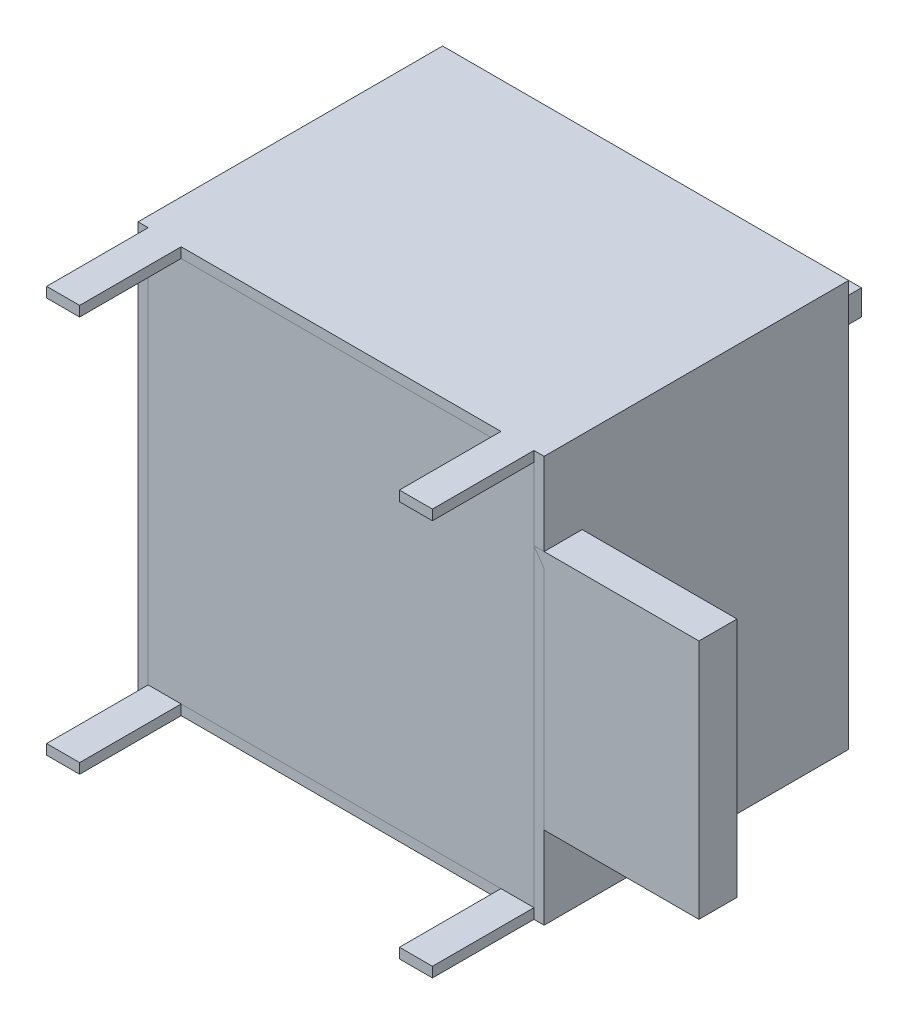
ISO-10303-21;
HEADER;
FILE_DESCRIPTION(('STEP AP214'),'2;1');
FILE_NAME('part.step','',(''),(''),'','','');
FILE_SCHEMA(('AUTOMOTIVE_DESIGN { 1 0 10303 214 1 1 1 1 }'));
ENDSEC;
DATA;
#1=APPLICATION_CONTEXT('core data for automotive mechanical design processes');
#2=APPLICATION_PROTOCOL_DEFINITION('international standard','automotive_design',2000,#1);
#3=PRODUCT_CONTEXT('',#1,'mechanical');
#4=PRODUCT('Part','Part','',(#3));
#5=PRODUCT_RELATED_PRODUCT_CATEGORY('part','',(#4));
#6=PRODUCT_DEFINITION_FORMATION('','',#4);
#7=PRODUCT_DEFINITION_CONTEXT('part definition',#1,'design');
#8=PRODUCT_DEFINITION('design','',#6,#7);
#9=PRODUCT_DEFINITION_SHAPE('','',#8);
#10=(LENGTH_UNIT() NAMED_UNIT(*) SI_UNIT(.MILLI.,.METRE.));
#11=(NAMED_UNIT(*) PLANE_ANGLE_UNIT() SI_UNIT($,.RADIAN.));
#12=(NAMED_UNIT(*) SI_UNIT($,.STERADIAN.) SOLID_ANGLE_UNIT());
#13=UNCERTAINTY_MEASURE_WITH_UNIT(LENGTH_MEASURE(1.E-05),#10,'distance_accuracy_value','');
#14=(GEOMETRIC_REPRESENTATION_CONTEXT(3) GLOBAL_UNCERTAINTY_ASSIGNED_CONTEXT((#13)) GLOBAL_UNIT_ASSIGNED_CONTEXT((#10,
#11,#12)) REPRESENTATION_CONTEXT('',''));
#15=CARTESIAN_POINT('',(0.,0.,0.));
#16=DIRECTION('',(0.,0.,1.));
#17=DIRECTION('',(1.,0.,0.));
#18=AXIS2_PLACEMENT_3D('',#15,#16,#17);
#19=CARTESIAN_POINT('',(0.4,15.6,10.5));
#20=DIRECTION('',(-1.,0.,0.));
#21=DIRECTION('',(0.,0.,1.));
#22=AXIS2_PLACEMENT_3D('',#19,#20,#21);
#23=PLANE('',#22);
#24=DIRECTION('',(0.,-1.,0.));
#25=VECTOR('',#24,1.);
#26=CARTESIAN_POINT('',(0.4,15.6,12.));
#27=LINE('',#26,#25);
#28=CARTESIAN_POINT('',(0.4,15.6,12.));
#29=VERTEX_POINT('',#28);
#30=CARTESIAN_POINT('',(0.4,0.399999999999999,12.));
#31=VERTEX_POINT('',#30);
#32=EDGE_CURVE('E144',#29,#31,#27,.T.);
#33=ORIENTED_EDGE('',*,*,#32,.F.);
#34=DIRECTION('',(0.,0.,1.));
#35=VECTOR('',#34,1.);
#36=CARTESIAN_POINT('',(0.4,15.6,10.5));
#37=LINE('',#36,#35);
#38=CARTESIAN_POINT('',(0.4,15.6,10.5));
#39=VERTEX_POINT('',#38);
#40=EDGE_CURVE('E12',#39,#29,#37,.T.);
#41=ORIENTED_EDGE('',*,*,#40,.F.);
#42=DIRECTION('',(0.,-1.,0.));
#43=VECTOR('',#42,1.);
#44=CARTESIAN_POINT('',(0.4,15.6,10.5));
#45=LINE('',#44,#43);
#46=CARTESIAN_POINT('',(0.4,0.399999999999999,10.5));
#47=VERTEX_POINT('',#46);
#48=EDGE_CURVE('E164',#39,#47,#45,.T.);
#49=ORIENTED_EDGE('',*,*,#48,.T.);
#50=DIRECTION('',(0.,0.,1.));
#51=VECTOR('',#50,1.);
#52=CARTESIAN_POINT('',(0.4,0.399999999999999,10.5));
#53=LINE('',#52,#51);
#54=EDGE_CURVE('E50',#47,#31,#53,.T.);
#55=ORIENTED_EDGE('',*,*,#54,.T.);
#56=EDGE_LOOP('',(#33,#41,#49,#55));
#57=FACE_BOUND('',#56,.T.);
#58=ADVANCED_FACE('F47',(#57),#23,.T.);
#59=CARTESIAN_POINT('',(0.4,15.6,10.5));
#60=DIRECTION('',(0.,1.,0.));
#61=DIRECTION('',(0.,0.,1.));
#62=AXIS2_PLACEMENT_3D('',#59,#60,#61);
#63=PLANE('',#62);
#64=DIRECTION('',(-1.,0.,0.));
#65=VECTOR('',#64,1.);
#66=CARTESIAN_POINT('',(0.4,15.6,12.));
#67=LINE('',#66,#65);
#68=CARTESIAN_POINT('',(15.6,15.6,12.));
#69=VERTEX_POINT('',#68);
#70=EDGE_CURVE('E162',#69,#29,#67,.T.);
#71=ORIENTED_EDGE('',*,*,#70,.F.);
#72=DIRECTION('',(0.,0.,1.));
#73=VECTOR('',#72,1.);
#74=CARTESIAN_POINT('',(15.6,15.6,10.5));
#75=LINE('',#74,#73);
#76=CARTESIAN_POINT('',(15.6,15.6,10.5));
#77=VERTEX_POINT('',#76);
#78=EDGE_CURVE('E56',#77,#69,#75,.T.);
#79=ORIENTED_EDGE('',*,*,#78,.F.);
#80=DIRECTION('',(-1.,0.,0.));
#81=VECTOR('',#80,1.);
#82=CARTESIAN_POINT('',(0.4,15.6,10.5));
#83=LINE('',#82,#81);
#84=EDGE_CURVE('E134',#77,#39,#83,.T.);
#85=ORIENTED_EDGE('',*,*,#84,.T.);
#86=ORIENTED_EDGE('',*,*,#40,.T.);
#87=EDGE_LOOP('',(#71,#79,#85,#86));
#88=FACE_BOUND('',#87,.T.);
#89=ADVANCED_FACE('F176',(#88),#63,.T.);
#90=CARTESIAN_POINT('',(15.6,15.6,10.5));
#91=DIRECTION('',(1.,0.,0.));
#92=DIRECTION('',(0.,1.,0.));
#93=AXIS2_PLACEMENT_3D('',#90,#91,#92);
#94=PLANE('',#93);
#95=DIRECTION('',(0.,1.,0.));
#96=VECTOR('',#95,1.);
#97=CARTESIAN_POINT('',(15.6,15.6,12.));
#98=LINE('',#97,#96);
#99=CARTESIAN_POINT('',(15.6,12.75,12.));
#100=VERTEX_POINT('',#99);
#101=EDGE_CURVE('E121',#100,#69,#98,.T.);
#102=ORIENTED_EDGE('',*,*,#101,.F.);
#103=DIRECTION('',(0.,0.,1.));
#104=VECTOR('',#103,1.);
#105=CARTESIAN_POINT('',(15.6,12.75,10.5));
#106=LINE('',#105,#104);
#107=CARTESIAN_POINT('',(15.6,12.75,10.5));
#108=VERTEX_POINT('',#107);
#109=EDGE_CURVE('E116',#108,#100,#106,.T.);
#110=ORIENTED_EDGE('',*,*,#109,.F.);
#111=DIRECTION('',(0.,1.,0.));
#112=VECTOR('',#111,1.);
#113=CARTESIAN_POINT('',(15.6,15.6,10.5));
#114=LINE('',#113,#112);
#115=EDGE_CURVE('E119',#108,#77,#114,.T.);
#116=ORIENTED_EDGE('',*,*,#115,.T.);
#117=ORIENTED_EDGE('',*,*,#78,.T.);
#118=EDGE_LOOP('',(#102,#110,#116,#117));
#119=FACE_BOUND('',#118,.T.);
#120=ADVANCED_FACE('F118',(#119),#94,.T.);
#121=CARTESIAN_POINT('',(15.6,12.75,10.5));
#122=DIRECTION('',(0.,1.,0.));
#123=DIRECTION('',(0.,0.,1.));
#124=AXIS2_PLACEMENT_3D('',#121,#122,#123);
#125=PLANE('',#124);
#126=DIRECTION('',(-1.,0.,0.));
#127=VECTOR('',#126,1.);
#128=CARTESIAN_POINT('',(15.6,12.75,12.));
#129=LINE('',#128,#127);
#130=CARTESIAN_POINT('',(22.1,12.75,12.));
#131=VERTEX_POINT('',#130);
#132=EDGE_CURVE('E159',#131,#100,#129,.T.);
#133=ORIENTED_EDGE('',*,*,#132,.F.);
#134=DIRECTION('',(0.,0.,1.));
#135=VECTOR('',#134,1.);
#136=CARTESIAN_POINT('',(22.1,12.75,10.5));
#137=LINE('',#136,#135);
#138=CARTESIAN_POINT('',(22.1,12.75,10.5));
#139=VERTEX_POINT('',#138);
#140=EDGE_CURVE('E126',#139,#131,#137,.T.);
#141=ORIENTED_EDGE('',*,*,#140,.F.);
#142=DIRECTION('',(-1.,0.,0.));
#143=VECTOR('',#142,1.);
#144=CARTESIAN_POINT('',(15.6,12.75,10.5));
#145=LINE('',#144,#143);
#146=EDGE_CURVE('E132',#139,#108,#145,.T.);
#147=ORIENTED_EDGE('',*,*,#146,.T.);
#148=ORIENTED_EDGE('',*,*,#109,.T.);
#149=EDGE_LOOP('',(#133,#141,#147,#148));
#150=FACE_BOUND('',#149,.T.);
#151=ADVANCED_FACE('F136',(#150),#125,.T.);
#152=CARTESIAN_POINT('',(22.1,12.75,10.5));
#153=DIRECTION('',(1.,0.,0.));
#154=DIRECTION('',(0.,0.,-1.));
#155=AXIS2_PLACEMENT_3D('',#152,#153,#154);
#156=PLANE('',#155);
#157=DIRECTION('',(0.,1.,0.));
#158=VECTOR('',#157,1.);
#159=CARTESIAN_POINT('',(22.1,12.75,12.));
#160=LINE('',#159,#158);
#161=CARTESIAN_POINT('',(22.1,3.25,12.));
#162=VERTEX_POINT('',#161);
#163=EDGE_CURVE('E156',#162,#131,#160,.T.);
#164=ORIENTED_EDGE('',*,*,#163,.F.);
#165=DIRECTION('',(0.,0.,1.));
#166=VECTOR('',#165,1.);
#167=CARTESIAN_POINT('',(22.1,3.25,10.5));
#168=LINE('',#167,#166);
#169=CARTESIAN_POINT('',(22.1,3.25,10.5));
#170=VERTEX_POINT('',#169);
#171=EDGE_CURVE('E168',#170,#162,#168,.T.);
#172=ORIENTED_EDGE('',*,*,#171,.F.);
#173=DIRECTION('',(0.,1.,0.));
#174=VECTOR('',#173,1.);
#175=CARTESIAN_POINT('',(22.1,12.75,10.5));
#176=LINE('',#175,#174);
#177=EDGE_CURVE('E137',#170,#139,#176,.T.);
#178=ORIENTED_EDGE('',*,*,#177,.T.);
#179=ORIENTED_EDGE('',*,*,#140,.T.);
#180=EDGE_LOOP('',(#164,#172,#178,#179));
#181=FACE_BOUND('',#180,.T.);
#182=ADVANCED_FACE('F189',(#181),#156,.T.);
#183=CARTESIAN_POINT('',(15.6,3.25,10.5));
#184=DIRECTION('',(0.,-1.,0.));
#185=DIRECTION('',(0.,0.,-1.));
#186=AXIS2_PLACEMENT_3D('',#183,#184,#185);
#187=PLANE('',#186);
#188=DIRECTION('',(1.,0.,0.));
#189=VECTOR('',#188,1.);
#190=CARTESIAN_POINT('',(15.6,3.25,12.));
#191=LINE('',#190,#189);
#192=CARTESIAN_POINT('',(15.6,3.25,12.));
#193=VERTEX_POINT('',#192);
#194=EDGE_CURVE('E153',#193,#162,#191,.T.);
#195=ORIENTED_EDGE('',*,*,#194,.F.);
#196=DIRECTION('',(0.,0.,1.));
#197=VECTOR('',#196,1.);
#198=CARTESIAN_POINT('',(15.6,3.25,10.5));
#199=LINE('',#198,#197);
#200=CARTESIAN_POINT('',(15.6,3.25,10.5));
#201=VERTEX_POINT('',#200);
#202=EDGE_CURVE('E170',#201,#193,#199,.T.);
#203=ORIENTED_EDGE('',*,*,#202,.F.);
#204=DIRECTION('',(1.,0.,0.));
#205=VECTOR('',#204,1.);
#206=CARTESIAN_POINT('',(15.6,3.25,10.5));
#207=LINE('',#206,#205);
#208=EDGE_CURVE('E139',#201,#170,#207,.T.);
#209=ORIENTED_EDGE('',*,*,#208,.T.);
#210=ORIENTED_EDGE('',*,*,#171,.T.);
#211=EDGE_LOOP('',(#195,#203,#209,#210));
#212=FACE_BOUND('',#211,.T.);
#213=ADVANCED_FACE('F192',(#212),#187,.T.);
#214=CARTESIAN_POINT('',(15.6,3.25,10.5));
#215=DIRECTION('',(1.,0.,0.));
#216=DIRECTION('',(0.,1.,0.));
#217=AXIS2_PLACEMENT_3D('',#214,#215,#216);
#218=PLANE('',#217);
#219=DIRECTION('',(0.,1.,0.));
#220=VECTOR('',#219,1.);
#221=CARTESIAN_POINT('',(15.6,3.25,12.));
#222=LINE('',#221,#220);
#223=CARTESIAN_POINT('',(15.6,0.399999999999999,12.));
#224=VERTEX_POINT('',#223);
#225=EDGE_CURVE('E150',#224,#193,#222,.T.);
#226=ORIENTED_EDGE('',*,*,#225,.F.);
#227=DIRECTION('',(0.,0.,1.));
#228=VECTOR('',#227,1.);
#229=CARTESIAN_POINT('',(15.6,0.399999999999999,10.5));
#230=LINE('',#229,#228);
#231=CARTESIAN_POINT('',(15.6,0.399999999999999,10.5));
#232=VERTEX_POINT('',#231);
#233=EDGE_CURVE('E171',#232,#224,#230,.T.);
#234=ORIENTED_EDGE('',*,*,#233,.F.);
#235=DIRECTION('',(0.,1.,0.));
#236=VECTOR('',#235,1.);
#237=CARTESIAN_POINT('',(15.6,3.25,10.5));
#238=LINE('',#237,#236);
#239=EDGE_CURVE('E267',#232,#201,#238,.T.);
#240=ORIENTED_EDGE('',*,*,#239,.T.);
#241=ORIENTED_EDGE('',*,*,#202,.T.);
#242=EDGE_LOOP('',(#226,#234,#240,#241));
#243=FACE_BOUND('',#242,.T.);
#244=ADVANCED_FACE('F196',(#243),#218,.T.);
#245=CARTESIAN_POINT('',(0.4,0.399999999999999,10.5));
#246=DIRECTION('',(0.,-1.,0.));
#247=DIRECTION('',(0.,0.,-1.));
#248=AXIS2_PLACEMENT_3D('',#245,#246,#247);
#249=PLANE('',#248);
#250=DIRECTION('',(1.,0.,0.));
#251=VECTOR('',#250,1.);
#252=CARTESIAN_POINT('',(0.4,0.399999999999999,12.));
#253=LINE('',#252,#251);
#254=EDGE_CURVE('E147',#31,#224,#253,.T.);
#255=ORIENTED_EDGE('',*,*,#254,.F.);
#256=ORIENTED_EDGE('',*,*,#54,.F.);
#257=DIRECTION('',(1.,0.,0.));
#258=VECTOR('',#257,1.);
#259=CARTESIAN_POINT('',(0.4,0.399999999999999,10.5));
#260=LINE('',#259,#258);
#261=EDGE_CURVE('E268',#47,#232,#260,.T.);
#262=ORIENTED_EDGE('',*,*,#261,.T.);
#263=ORIENTED_EDGE('',*,*,#233,.T.);
#264=EDGE_LOOP('',(#255,#256,#262,#263));
#265=FACE_BOUND('',#264,.T.);
#266=ADVANCED_FACE('F173',(#265),#249,.T.);
#267=CARTESIAN_POINT('',(0.,0.,10.5));
#268=DIRECTION('',(0.,0.,1.));
#269=DIRECTION('',(1.,0.,0.));
#270=AXIS2_PLACEMENT_3D('',#267,#268,#269);
#271=PLANE('',#270);
#272=ORIENTED_EDGE('',*,*,#48,.F.);
#273=ORIENTED_EDGE('',*,*,#84,.F.);
#274=ORIENTED_EDGE('',*,*,#115,.F.);
#275=ORIENTED_EDGE('',*,*,#146,.F.);
#276=ORIENTED_EDGE('',*,*,#177,.F.);
#277=ORIENTED_EDGE('',*,*,#208,.F.);
#278=ORIENTED_EDGE('',*,*,#239,.F.);
#279=ORIENTED_EDGE('',*,*,#261,.F.);
#280=EDGE_LOOP('',(#272,#273,#274,#275,#276,#277,#278,#279));
#281=FACE_BOUND('',#280,.T.);
#282=ADVANCED_FACE('F130',(#281),#271,.F.);
#283=CARTESIAN_POINT('',(0.,0.,12.));
#284=DIRECTION('',(0.,0.,1.));
#285=DIRECTION('',(1.,0.,0.));
#286=AXIS2_PLACEMENT_3D('',#283,#284,#285);
#287=PLANE('',#286);
#288=ORIENTED_EDGE('',*,*,#32,.T.);
#289=ORIENTED_EDGE('',*,*,#254,.T.);
#290=ORIENTED_EDGE('',*,*,#225,.T.);
#291=ORIENTED_EDGE('',*,*,#194,.T.);
#292=ORIENTED_EDGE('',*,*,#163,.T.);
#293=ORIENTED_EDGE('',*,*,#132,.T.);
#294=ORIENTED_EDGE('',*,*,#101,.T.);
#295=ORIENTED_EDGE('',*,*,#70,.T.);
#296=EDGE_LOOP('',(#288,#289,#290,#291,#292,#293,#294,#295));
#297=FACE_BOUND('',#296,.T.);
#298=ADVANCED_FACE('F175',(#297),#287,.T.);
#299=CLOSED_SHELL('',(#58,#89,#120,#151,#182,#213,#244,#266,#282,#298));
#300=MANIFOLD_SOLID_BREP('B2',#299);
#301=CARTESIAN_POINT('',(0.,0.,0.));
#302=DIRECTION('',(0.,0.,-1.));
#303=DIRECTION('',(-1.,0.,0.));
#304=AXIS2_PLACEMENT_3D('',#301,#302,#303);
#305=PLANE('',#304);
#306=DIRECTION('',(0.,-1.,0.));
#307=VECTOR('',#306,1.);
#308=CARTESIAN_POINT('',(0.,0.,0.));
#309=LINE('',#308,#307);
#310=CARTESIAN_POINT('',(0.,16.,0.));
#311=VERTEX_POINT('',#310);
#312=CARTESIAN_POINT('',(0.,0.,0.));
#313=VERTEX_POINT('',#312);
#314=EDGE_CURVE('E615',#311,#313,#309,.T.);
#315=ORIENTED_EDGE('',*,*,#314,.F.);
#316=DIRECTION('',(-1.,0.,0.));
#317=VECTOR('',#316,1.);
#318=CARTESIAN_POINT('',(0.,16.,0.));
#319=LINE('',#318,#317);
#320=CARTESIAN_POINT('',(16.,16.,0.));
#321=VERTEX_POINT('',#320);
#322=EDGE_CURVE('E607',#321,#311,#319,.T.);
#323=ORIENTED_EDGE('',*,*,#322,.F.);
#324=DIRECTION('',(0.,1.,0.));
#325=VECTOR('',#324,1.);
#326=CARTESIAN_POINT('',(16.,0.,0.));
#327=LINE('',#326,#325);
#328=CARTESIAN_POINT('',(16.,0.,0.));
#329=VERTEX_POINT('',#328);
#330=EDGE_CURVE('E631',#329,#321,#327,.T.);
#331=ORIENTED_EDGE('',*,*,#330,.F.);
#332=DIRECTION('',(1.,0.,0.));
#333=VECTOR('',#332,1.);
#334=CARTESIAN_POINT('',(0.,0.,0.));
#335=LINE('',#334,#333);
#336=EDGE_CURVE('E632',#313,#329,#335,.T.);
#337=ORIENTED_EDGE('',*,*,#336,.F.);
#338=EDGE_LOOP('',(#315,#323,#331,#337));
#339=FACE_BOUND('',#338,.T.);
#340=DIRECTION('',(1.,0.,0.));
#341=VECTOR('',#340,1.);
#342=CARTESIAN_POINT('',(9.,8.5,0.));
#343=LINE('',#342,#341);
#344=CARTESIAN_POINT('',(7.,8.5,0.));
#345=VERTEX_POINT('',#344);
#346=CARTESIAN_POINT('',(9.,8.5,0.));
#347=VERTEX_POINT('',#346);
#348=EDGE_CURVE('E1034',#345,#347,#343,.T.);
#349=ORIENTED_EDGE('',*,*,#348,.F.);
#350=DIRECTION('',(0.,1.,0.));
#351=VECTOR('',#350,1.);
#352=CARTESIAN_POINT('',(7.,8.5,0.));
#353=LINE('',#352,#351);
#354=CARTESIAN_POINT('',(7.,7.5,0.));
#355=VERTEX_POINT('',#354);
#356=EDGE_CURVE('E474',#355,#345,#353,.T.);
#357=ORIENTED_EDGE('',*,*,#356,.F.);
#358=DIRECTION('',(-1.,0.,0.));
#359=VECTOR('',#358,1.);
#360=CARTESIAN_POINT('',(9.,7.5,0.));
#361=LINE('',#360,#359);
#362=CARTESIAN_POINT('',(9.,7.5,0.));
#363=VERTEX_POINT('',#362);
#364=EDGE_CURVE('E470',#363,#355,#361,.T.);
#365=ORIENTED_EDGE('',*,*,#364,.F.);
#366=DIRECTION('',(0.,-1.,0.));
#367=VECTOR('',#366,1.);
#368=CARTESIAN_POINT('',(9.,8.5,0.));
#369=LINE('',#368,#367);
#370=EDGE_CURVE('E1031',#347,#363,#369,.T.);
#371=ORIENTED_EDGE('',*,*,#370,.F.);
#372=EDGE_LOOP('',(#349,#357,#365,#371));
#373=FACE_BOUND('',#372,.T.);
#374=ADVANCED_FACE('F275',(#339,#373),#305,.T.);
#375=CARTESIAN_POINT('',(0.,0.,12.));
#376=DIRECTION('',(0.,0.,-1.));
#377=DIRECTION('',(-1.,0.,0.));
#378=AXIS2_PLACEMENT_3D('',#375,#376,#377);
#379=PLANE('',#378);
#380=DIRECTION('',(1.,0.,0.));
#381=VECTOR('',#380,1.);
#382=CARTESIAN_POINT('',(0.,0.,12.));
#383=LINE('',#382,#381);
#384=CARTESIAN_POINT('',(0.,0.,12.));
#385=VERTEX_POINT('',#384);
#386=CARTESIAN_POINT('',(0.4,0.,12.));
#387=VERTEX_POINT('',#386);
#388=EDGE_CURVE('E608',#385,#387,#383,.T.);
#389=ORIENTED_EDGE('',*,*,#388,.T.);
#390=DIRECTION('',(0.,1.,0.));
#391=VECTOR('',#390,1.);
#392=CARTESIAN_POINT('',(0.4,0.399999999999999,12.));
#393=LINE('',#392,#391);
#394=CARTESIAN_POINT('',(0.4,0.399999999999999,12.));
#395=VERTEX_POINT('',#394);
#396=EDGE_CURVE('E476',#387,#395,#393,.T.);
#397=ORIENTED_EDGE('',*,*,#396,.T.);
#398=DIRECTION('',(0.,-1.,0.));
#399=VECTOR('',#398,1.);
#400=CARTESIAN_POINT('',(0.4,0.,12.));
#401=LINE('',#400,#399);
#402=CARTESIAN_POINT('',(0.4,15.6,12.));
#403=VERTEX_POINT('',#402);
#404=EDGE_CURVE('E663',#403,#395,#401,.T.);
#405=ORIENTED_EDGE('',*,*,#404,.F.);
#406=DIRECTION('',(0.,-1.,0.));
#407=VECTOR('',#406,1.);
#408=CARTESIAN_POINT('',(0.4,15.6,12.));
#409=LINE('',#408,#407);
#410=CARTESIAN_POINT('',(0.4,16.,12.));
#411=VERTEX_POINT('',#410);
#412=EDGE_CURVE('E556',#411,#403,#409,.T.);
#413=ORIENTED_EDGE('',*,*,#412,.F.);
#414=DIRECTION('',(-1.,0.,0.));
#415=VECTOR('',#414,1.);
#416=CARTESIAN_POINT('',(0.,16.,12.));
#417=LINE('',#416,#415);
#418=CARTESIAN_POINT('',(0.,16.,12.));
#419=VERTEX_POINT('',#418);
#420=EDGE_CURVE('E576',#411,#419,#417,.T.);
#421=ORIENTED_EDGE('',*,*,#420,.T.);
#422=DIRECTION('',(0.,-1.,0.));
#423=VECTOR('',#422,1.);
#424=CARTESIAN_POINT('',(0.,0.,12.));
#425=LINE('',#424,#423);
#426=EDGE_CURVE('E603',#419,#385,#425,.T.);
#427=ORIENTED_EDGE('',*,*,#426,.T.);
#428=EDGE_LOOP('',(#389,#397,#405,#413,#421,#427));
#429=FACE_BOUND('',#428,.T.);
#430=ADVANCED_FACE('F719',(#429),#379,.F.);
#431=DIRECTION('',(0.,1.,0.));
#432=VECTOR('',#431,1.);
#433=CARTESIAN_POINT('',(15.6,0.399999999999999,12.));
#434=LINE('',#433,#432);
#435=CARTESIAN_POINT('',(15.6,0.,12.));
#436=VERTEX_POINT('',#435);
#437=CARTESIAN_POINT('',(15.6,0.4,12.));
#438=VERTEX_POINT('',#437);
#439=EDGE_CURVE('E504',#436,#438,#434,.T.);
#440=ORIENTED_EDGE('',*,*,#439,.F.);
#441=CARTESIAN_POINT('',(16.,0.,12.));
#442=VERTEX_POINT('',#441);
#443=EDGE_CURVE('E606',#436,#442,#383,.T.);
#444=ORIENTED_EDGE('',*,*,#443,.T.);
#445=DIRECTION('',(0.,1.,0.));
#446=VECTOR('',#445,1.);
#447=CARTESIAN_POINT('',(16.,0.,12.));
#448=LINE('',#447,#446);
#449=CARTESIAN_POINT('',(16.,16.,12.));
#450=VERTEX_POINT('',#449);
#451=EDGE_CURVE('E611',#442,#450,#448,.T.);
#452=ORIENTED_EDGE('',*,*,#451,.T.);
#453=CARTESIAN_POINT('',(15.6,16.,12.));
#454=VERTEX_POINT('',#453);
#455=EDGE_CURVE('E619',#450,#454,#417,.T.);
#456=ORIENTED_EDGE('',*,*,#455,.T.);
#457=DIRECTION('',(0.,-1.,0.));
#458=VECTOR('',#457,1.);
#459=CARTESIAN_POINT('',(15.6,15.6,12.));
#460=LINE('',#459,#458);
#461=CARTESIAN_POINT('',(15.6,15.6,12.));
#462=VERTEX_POINT('',#461);
#463=EDGE_CURVE('E529',#454,#462,#460,.T.);
#464=ORIENTED_EDGE('',*,*,#463,.T.);
#465=DIRECTION('',(0.,1.,0.));
#466=VECTOR('',#465,1.);
#467=CARTESIAN_POINT('',(15.6,0.,12.));
#468=LINE('',#467,#466);
#469=EDGE_CURVE('E598',#438,#462,#468,.T.);
#470=ORIENTED_EDGE('',*,*,#469,.F.);
#471=EDGE_LOOP('',(#440,#444,#452,#456,#464,#470));
#472=FACE_BOUND('',#471,.T.);
#473=ADVANCED_FACE('F678',(#472),#379,.F.);
#474=DIRECTION('',(1.,0.,0.));
#475=VECTOR('',#474,1.);
#476=CARTESIAN_POINT('',(0.,0.4,12.));
#477=LINE('',#476,#475);
#478=CARTESIAN_POINT('',(1.7,0.4,12.));
#479=VERTEX_POINT('',#478);
#480=CARTESIAN_POINT('',(14.3,0.399999999999999,12.));
#481=VERTEX_POINT('',#480);
#482=EDGE_CURVE('E664',#479,#481,#477,.T.);
#483=ORIENTED_EDGE('',*,*,#482,.F.);
#484=DIRECTION('',(0.,-1.,0.));
#485=VECTOR('',#484,1.);
#486=CARTESIAN_POINT('',(1.7,0.399999999999999,12.));
#487=LINE('',#486,#485);
#488=CARTESIAN_POINT('',(1.7,0.,12.));
#489=VERTEX_POINT('',#488);
#490=EDGE_CURVE('E301',#479,#489,#487,.T.);
#491=ORIENTED_EDGE('',*,*,#490,.T.);
#492=CARTESIAN_POINT('',(14.3,0.,12.));
#493=VERTEX_POINT('',#492);
#494=EDGE_CURVE('E612',#489,#493,#383,.T.);
#495=ORIENTED_EDGE('',*,*,#494,.T.);
#496=DIRECTION('',(0.,-1.,0.));
#497=VECTOR('',#496,1.);
#498=CARTESIAN_POINT('',(14.3,0.399999999999999,12.));
#499=LINE('',#498,#497);
#500=EDGE_CURVE('E509',#481,#493,#499,.T.);
#501=ORIENTED_EDGE('',*,*,#500,.F.);
#502=EDGE_LOOP('',(#483,#491,#495,#501));
#503=FACE_BOUND('',#502,.T.);
#504=ADVANCED_FACE('F700',(#503),#379,.F.);
#505=DIRECTION('',(-1.,0.,0.));
#506=VECTOR('',#505,1.);
#507=CARTESIAN_POINT('',(0.,15.6,12.));
#508=LINE('',#507,#506);
#509=CARTESIAN_POINT('',(14.3,15.6,12.));
#510=VERTEX_POINT('',#509);
#511=CARTESIAN_POINT('',(1.7,15.6,12.));
#512=VERTEX_POINT('',#511);
#513=EDGE_CURVE('E595',#510,#512,#508,.T.);
#514=ORIENTED_EDGE('',*,*,#513,.F.);
#515=DIRECTION('',(0.,1.,0.));
#516=VECTOR('',#515,1.);
#517=CARTESIAN_POINT('',(14.3,15.6,12.));
#518=LINE('',#517,#516);
#519=CARTESIAN_POINT('',(14.3,16.,12.));
#520=VERTEX_POINT('',#519);
#521=EDGE_CURVE('E534',#510,#520,#518,.T.);
#522=ORIENTED_EDGE('',*,*,#521,.T.);
#523=CARTESIAN_POINT('',(1.7,16.,12.));
#524=VERTEX_POINT('',#523);
#525=EDGE_CURVE('E279',#520,#524,#417,.T.);
#526=ORIENTED_EDGE('',*,*,#525,.T.);
#527=DIRECTION('',(0.,1.,0.));
#528=VECTOR('',#527,1.);
#529=CARTESIAN_POINT('',(1.7,15.6,12.));
#530=LINE('',#529,#528);
#531=EDGE_CURVE('E561',#512,#524,#530,.T.);
#532=ORIENTED_EDGE('',*,*,#531,.F.);
#533=EDGE_LOOP('',(#514,#522,#526,#532));
#534=FACE_BOUND('',#533,.T.);
#535=ADVANCED_FACE('F727',(#534),#379,.F.);
#536=CARTESIAN_POINT('',(0.,0.,12.));
#537=DIRECTION('',(1.,0.,0.));
#538=DIRECTION('',(0.,0.,-1.));
#539=AXIS2_PLACEMENT_3D('',#536,#537,#538);
#540=PLANE('',#539);
#541=ORIENTED_EDGE('',*,*,#314,.T.);
#542=DIRECTION('',(0.,0.,-1.));
#543=VECTOR('',#542,1.);
#544=CARTESIAN_POINT('',(0.,0.,12.));
#545=LINE('',#544,#543);
#546=EDGE_CURVE('E45',#385,#313,#545,.T.);
#547=ORIENTED_EDGE('',*,*,#546,.F.);
#548=ORIENTED_EDGE('',*,*,#426,.F.);
#549=DIRECTION('',(0.,0.,-1.));
#550=VECTOR('',#549,1.);
#551=CARTESIAN_POINT('',(0.,16.,12.));
#552=LINE('',#551,#550);
#553=EDGE_CURVE('E621',#419,#311,#552,.T.);
#554=ORIENTED_EDGE('',*,*,#553,.T.);
#555=EDGE_LOOP('',(#541,#547,#548,#554));
#556=FACE_BOUND('',#555,.T.);
#557=ADVANCED_FACE('F277',(#556),#540,.F.);
#558=CARTESIAN_POINT('',(0.,0.,12.));
#559=DIRECTION('',(0.,1.,0.));
#560=DIRECTION('',(0.,0.,1.));
#561=AXIS2_PLACEMENT_3D('',#558,#559,#560);
#562=PLANE('',#561);
#563=ORIENTED_EDGE('',*,*,#336,.T.);
#564=DIRECTION('',(0.,0.,-1.));
#565=VECTOR('',#564,1.);
#566=CARTESIAN_POINT('',(16.,0.,12.));
#567=LINE('',#566,#565);
#568=EDGE_CURVE('E285',#442,#329,#567,.T.);
#569=ORIENTED_EDGE('',*,*,#568,.F.);
#570=ORIENTED_EDGE('',*,*,#443,.F.);
#571=DIRECTION('',(0.,0.,-1.));
#572=VECTOR('',#571,1.);
#573=CARTESIAN_POINT('',(15.6,0.,16.));
#574=LINE('',#573,#572);
#575=CARTESIAN_POINT('',(15.6,0.,16.));
#576=VERTEX_POINT('',#575);
#577=EDGE_CURVE('E515',#576,#436,#574,.T.);
#578=ORIENTED_EDGE('',*,*,#577,.F.);
#579=DIRECTION('',(1.,0.,0.));
#580=VECTOR('',#579,1.);
#581=CARTESIAN_POINT('',(15.6,0.,16.));
#582=LINE('',#581,#580);
#583=CARTESIAN_POINT('',(14.3,0.,16.));
#584=VERTEX_POINT('',#583);
#585=EDGE_CURVE('E513',#584,#576,#582,.T.);
#586=ORIENTED_EDGE('',*,*,#585,.F.);
#587=DIRECTION('',(0.,0.,-1.));
#588=VECTOR('',#587,1.);
#589=CARTESIAN_POINT('',(14.3,0.,16.));
#590=LINE('',#589,#588);
#591=EDGE_CURVE('E520',#584,#493,#590,.T.);
#592=ORIENTED_EDGE('',*,*,#591,.T.);
#593=ORIENTED_EDGE('',*,*,#494,.F.);
#594=DIRECTION('',(0.,0.,-1.));
#595=VECTOR('',#594,1.);
#596=CARTESIAN_POINT('',(1.7,0.,16.));
#597=LINE('',#596,#595);
#598=CARTESIAN_POINT('',(1.7,0.,16.));
#599=VERTEX_POINT('',#598);
#600=EDGE_CURVE('E500',#599,#489,#597,.T.);
#601=ORIENTED_EDGE('',*,*,#600,.F.);
#602=DIRECTION('',(-1.,0.,0.));
#603=VECTOR('',#602,1.);
#604=CARTESIAN_POINT('',(0.4,0.,16.));
#605=LINE('',#604,#603);
#606=CARTESIAN_POINT('',(0.4,0.,16.));
#607=VERTEX_POINT('',#606);
#608=EDGE_CURVE('E486',#599,#607,#605,.T.);
#609=ORIENTED_EDGE('',*,*,#608,.T.);
#610=DIRECTION('',(0.,0.,-1.));
#611=VECTOR('',#610,1.);
#612=CARTESIAN_POINT('',(0.4,0.,16.));
#613=LINE('',#612,#611);
#614=EDGE_CURVE('E502',#607,#387,#613,.T.);
#615=ORIENTED_EDGE('',*,*,#614,.T.);
#616=ORIENTED_EDGE('',*,*,#388,.F.);
#617=ORIENTED_EDGE('',*,*,#546,.T.);
#618=EDGE_LOOP('',(#563,#569,#570,#578,#586,#592,#593,#601,#609,#615,#616,#617));
#619=FACE_BOUND('',#618,.T.);
#620=ADVANCED_FACE('F695',(#619),#562,.F.);
#621=CARTESIAN_POINT('',(16.,0.,12.));
#622=DIRECTION('',(-1.,0.,0.));
#623=DIRECTION('',(0.,0.,1.));
#624=AXIS2_PLACEMENT_3D('',#621,#622,#623);
#625=PLANE('',#624);
#626=ORIENTED_EDGE('',*,*,#330,.T.);
#627=DIRECTION('',(0.,0.,-1.));
#628=VECTOR('',#627,1.);
#629=CARTESIAN_POINT('',(16.,16.,12.));
#630=LINE('',#629,#628);
#631=EDGE_CURVE('E625',#450,#321,#630,.T.);
#632=ORIENTED_EDGE('',*,*,#631,.F.);
#633=ORIENTED_EDGE('',*,*,#451,.F.);
#634=ORIENTED_EDGE('',*,*,#568,.T.);
#635=EDGE_LOOP('',(#626,#632,#633,#634));
#636=FACE_BOUND('',#635,.T.);
#637=ADVANCED_FACE('F735',(#636),#625,.F.);
#638=CARTESIAN_POINT('',(0.,16.,12.));
#639=DIRECTION('',(0.,-1.,0.));
#640=DIRECTION('',(0.,0.,-1.));
#641=AXIS2_PLACEMENT_3D('',#638,#639,#640);
#642=PLANE('',#641);
#643=ORIENTED_EDGE('',*,*,#322,.T.);
#644=ORIENTED_EDGE('',*,*,#553,.F.);
#645=ORIENTED_EDGE('',*,*,#420,.F.);
#646=DIRECTION('',(0.,0.,-1.));
#647=VECTOR('',#646,1.);
#648=CARTESIAN_POINT('',(0.4,16.,16.));
#649=LINE('',#648,#647);
#650=CARTESIAN_POINT('',(0.4,16.,16.));
#651=VERTEX_POINT('',#650);
#652=EDGE_CURVE('E567',#651,#411,#649,.T.);
#653=ORIENTED_EDGE('',*,*,#652,.F.);
#654=DIRECTION('',(-1.,0.,0.));
#655=VECTOR('',#654,1.);
#656=CARTESIAN_POINT('',(0.4,16.,16.));
#657=LINE('',#656,#655);
#658=CARTESIAN_POINT('',(1.7,16.,16.));
#659=VERTEX_POINT('',#658);
#660=EDGE_CURVE('E565',#659,#651,#657,.T.);
#661=ORIENTED_EDGE('',*,*,#660,.F.);
#662=DIRECTION('',(0.,0.,-1.));
#663=VECTOR('',#662,1.);
#664=CARTESIAN_POINT('',(1.7,16.,16.));
#665=LINE('',#664,#663);
#666=EDGE_CURVE('E578',#659,#524,#665,.T.);
#667=ORIENTED_EDGE('',*,*,#666,.T.);
#668=ORIENTED_EDGE('',*,*,#525,.F.);
#669=DIRECTION('',(0.,0.,-1.));
#670=VECTOR('',#669,1.);
#671=CARTESIAN_POINT('',(14.3,16.,16.));
#672=LINE('',#671,#670);
#673=CARTESIAN_POINT('',(14.3,16.,16.));
#674=VERTEX_POINT('',#673);
#675=EDGE_CURVE('E552',#674,#520,#672,.T.);
#676=ORIENTED_EDGE('',*,*,#675,.F.);
#677=DIRECTION('',(1.,0.,0.));
#678=VECTOR('',#677,1.);
#679=CARTESIAN_POINT('',(15.6,16.,16.));
#680=LINE('',#679,#678);
#681=CARTESIAN_POINT('',(15.6,16.,16.));
#682=VERTEX_POINT('',#681);
#683=EDGE_CURVE('E533',#674,#682,#680,.T.);
#684=ORIENTED_EDGE('',*,*,#683,.T.);
#685=DIRECTION('',(0.,0.,-1.));
#686=VECTOR('',#685,1.);
#687=CARTESIAN_POINT('',(15.6,16.,16.));
#688=LINE('',#687,#686);
#689=EDGE_CURVE('E554',#682,#454,#688,.T.);
#690=ORIENTED_EDGE('',*,*,#689,.T.);
#691=ORIENTED_EDGE('',*,*,#455,.F.);
#692=ORIENTED_EDGE('',*,*,#631,.T.);
#693=EDGE_LOOP('',(#643,#644,#645,#653,#661,#667,#668,#676,#684,#690,#691,#692));
#694=FACE_BOUND('',#693,.T.);
#695=ADVANCED_FACE('F731',(#694),#642,.F.);
#696=CARTESIAN_POINT('',(0.4,0.,12.));
#697=DIRECTION('',(1.,0.,0.));
#698=DIRECTION('',(0.,0.,-1.));
#699=AXIS2_PLACEMENT_3D('',#696,#697,#698);
#700=PLANE('',#699);
#701=DIRECTION('',(0.,-1.,0.));
#702=VECTOR('',#701,1.);
#703=CARTESIAN_POINT('',(0.4,0.,0.4));
#704=LINE('',#703,#702);
#705=CARTESIAN_POINT('',(0.4,15.6,0.4));
#706=VERTEX_POINT('',#705);
#707=CARTESIAN_POINT('',(0.4,0.4,0.4));
#708=VERTEX_POINT('',#707);
#709=EDGE_CURVE('E652',#706,#708,#704,.T.);
#710=ORIENTED_EDGE('',*,*,#709,.F.);
#711=DIRECTION('',(0.,0.,-1.));
#712=VECTOR('',#711,1.);
#713=CARTESIAN_POINT('',(0.4,15.6,12.));
#714=LINE('',#713,#712);
#715=EDGE_CURVE('E597',#403,#706,#714,.T.);
#716=ORIENTED_EDGE('',*,*,#715,.F.);
#717=ORIENTED_EDGE('',*,*,#404,.T.);
#718=DIRECTION('',(0.,0.,-1.));
#719=VECTOR('',#718,1.);
#720=CARTESIAN_POINT('',(0.4,0.4,12.));
#721=LINE('',#720,#719);
#722=EDGE_CURVE('E636',#395,#708,#721,.T.);
#723=ORIENTED_EDGE('',*,*,#722,.T.);
#724=EDGE_LOOP('',(#710,#716,#717,#723));
#725=FACE_BOUND('',#724,.T.);
#726=ADVANCED_FACE('F734',(#725),#700,.T.);
#727=CARTESIAN_POINT('',(0.,0.4,12.));
#728=DIRECTION('',(0.,1.,0.));
#729=DIRECTION('',(0.,0.,1.));
#730=AXIS2_PLACEMENT_3D('',#727,#728,#729);
#731=PLANE('',#730);
#732=DIRECTION('',(1.,0.,0.));
#733=VECTOR('',#732,1.);
#734=CARTESIAN_POINT('',(0.,0.4,0.4));
#735=LINE('',#734,#733);
#736=CARTESIAN_POINT('',(15.6,0.4,0.4));
#737=VERTEX_POINT('',#736);
#738=EDGE_CURVE('E655',#708,#737,#735,.T.);
#739=ORIENTED_EDGE('',*,*,#738,.F.);
#740=ORIENTED_EDGE('',*,*,#722,.F.);
#741=DIRECTION('',(0.,0.,-1.));
#742=VECTOR('',#741,1.);
#743=CARTESIAN_POINT('',(0.4,0.399999999999999,16.));
#744=LINE('',#743,#742);
#745=CARTESIAN_POINT('',(0.4,0.399999999999999,16.));
#746=VERTEX_POINT('',#745);
#747=EDGE_CURVE('E494',#746,#395,#744,.T.);
#748=ORIENTED_EDGE('',*,*,#747,.F.);
#749=DIRECTION('',(1.,0.,0.));
#750=VECTOR('',#749,1.);
#751=CARTESIAN_POINT('',(0.4,0.399999999999999,16.));
#752=LINE('',#751,#750);
#753=CARTESIAN_POINT('',(1.7,0.399999999999999,16.));
#754=VERTEX_POINT('',#753);
#755=EDGE_CURVE('E492',#746,#754,#752,.T.);
#756=ORIENTED_EDGE('',*,*,#755,.T.);
#757=DIRECTION('',(0.,0.,-1.));
#758=VECTOR('',#757,1.);
#759=CARTESIAN_POINT('',(1.7,0.399999999999999,16.));
#760=LINE('',#759,#758);
#761=EDGE_CURVE('E498',#754,#479,#760,.T.);
#762=ORIENTED_EDGE('',*,*,#761,.T.);
#763=ORIENTED_EDGE('',*,*,#482,.T.);
#764=DIRECTION('',(0.,0.,-1.));
#765=VECTOR('',#764,1.);
#766=CARTESIAN_POINT('',(14.3,0.399999999999999,16.));
#767=LINE('',#766,#765);
#768=CARTESIAN_POINT('',(14.3,0.399999999999999,16.));
#769=VERTEX_POINT('',#768);
#770=EDGE_CURVE('E523',#769,#481,#767,.T.);
#771=ORIENTED_EDGE('',*,*,#770,.F.);
#772=DIRECTION('',(-1.,0.,0.));
#773=VECTOR('',#772,1.);
#774=CARTESIAN_POINT('',(15.6,0.399999999999999,16.));
#775=LINE('',#774,#773);
#776=CARTESIAN_POINT('',(15.6,0.399999999999999,16.));
#777=VERTEX_POINT('',#776);
#778=EDGE_CURVE('E508',#777,#769,#775,.T.);
#779=ORIENTED_EDGE('',*,*,#778,.F.);
#780=DIRECTION('',(0.,0.,-1.));
#781=VECTOR('',#780,1.);
#782=CARTESIAN_POINT('',(15.6,0.399999999999999,16.));
#783=LINE('',#782,#781);
#784=EDGE_CURVE('E526',#777,#438,#783,.T.);
#785=ORIENTED_EDGE('',*,*,#784,.T.);
#786=DIRECTION('',(0.,0.,-1.));
#787=VECTOR('',#786,1.);
#788=CARTESIAN_POINT('',(15.6,0.4,12.));
#789=LINE('',#788,#787);
#790=EDGE_CURVE('E641',#438,#737,#789,.T.);
#791=ORIENTED_EDGE('',*,*,#790,.T.);
#792=EDGE_LOOP('',(#739,#740,#748,#756,#762,#763,#771,#779,#785,#791));
#793=FACE_BOUND('',#792,.T.);
#794=ADVANCED_FACE('F688',(#793),#731,.T.);
#795=CARTESIAN_POINT('',(15.6,0.,12.));
#796=DIRECTION('',(-1.,0.,0.));
#797=DIRECTION('',(0.,0.,1.));
#798=AXIS2_PLACEMENT_3D('',#795,#796,#797);
#799=PLANE('',#798);
#800=DIRECTION('',(0.,1.,0.));
#801=VECTOR('',#800,1.);
#802=CARTESIAN_POINT('',(15.6,0.,0.4));
#803=LINE('',#802,#801);
#804=CARTESIAN_POINT('',(15.6,15.6,0.4));
#805=VERTEX_POINT('',#804);
#806=EDGE_CURVE('E656',#737,#805,#803,.T.);
#807=ORIENTED_EDGE('',*,*,#806,.F.);
#808=ORIENTED_EDGE('',*,*,#790,.F.);
#809=ORIENTED_EDGE('',*,*,#469,.T.);
#810=DIRECTION('',(0.,0.,-1.));
#811=VECTOR('',#810,1.);
#812=CARTESIAN_POINT('',(15.6,15.6,12.));
#813=LINE('',#812,#811);
#814=EDGE_CURVE('E649',#462,#805,#813,.T.);
#815=ORIENTED_EDGE('',*,*,#814,.T.);
#816=EDGE_LOOP('',(#807,#808,#809,#815));
#817=FACE_BOUND('',#816,.T.);
#818=ADVANCED_FACE('F673',(#817),#799,.T.);
#819=CARTESIAN_POINT('',(0.,15.6,12.));
#820=DIRECTION('',(0.,-1.,0.));
#821=DIRECTION('',(0.,0.,-1.));
#822=AXIS2_PLACEMENT_3D('',#819,#820,#821);
#823=PLANE('',#822);
#824=DIRECTION('',(-1.,0.,0.));
#825=VECTOR('',#824,1.);
#826=CARTESIAN_POINT('',(0.,15.6,0.4));
#827=LINE('',#826,#825);
#828=EDGE_CURVE('E659',#805,#706,#827,.T.);
#829=ORIENTED_EDGE('',*,*,#828,.F.);
#830=ORIENTED_EDGE('',*,*,#814,.F.);
#831=DIRECTION('',(0.,0.,-1.));
#832=VECTOR('',#831,1.);
#833=CARTESIAN_POINT('',(15.6,15.6,16.));
#834=LINE('',#833,#832);
#835=CARTESIAN_POINT('',(15.6,15.6,16.));
#836=VERTEX_POINT('',#835);
#837=EDGE_CURVE('E543',#836,#462,#834,.T.);
#838=ORIENTED_EDGE('',*,*,#837,.F.);
#839=DIRECTION('',(-1.,0.,0.));
#840=VECTOR('',#839,1.);
#841=CARTESIAN_POINT('',(15.6,15.6,16.));
#842=LINE('',#841,#840);
#843=CARTESIAN_POINT('',(14.3,15.6,16.));
#844=VERTEX_POINT('',#843);
#845=EDGE_CURVE('E540',#836,#844,#842,.T.);
#846=ORIENTED_EDGE('',*,*,#845,.T.);
#847=DIRECTION('',(0.,0.,-1.));
#848=VECTOR('',#847,1.);
#849=CARTESIAN_POINT('',(14.3,15.6,16.));
#850=LINE('',#849,#848);
#851=EDGE_CURVE('E549',#844,#510,#850,.T.);
#852=ORIENTED_EDGE('',*,*,#851,.T.);
#853=ORIENTED_EDGE('',*,*,#513,.T.);
#854=DIRECTION('',(0.,0.,-1.));
#855=VECTOR('',#854,1.);
#856=CARTESIAN_POINT('',(1.7,15.6,16.));
#857=LINE('',#856,#855);
#858=CARTESIAN_POINT('',(1.7,15.6,16.));
#859=VERTEX_POINT('',#858);
#860=EDGE_CURVE('E581',#859,#512,#857,.T.);
#861=ORIENTED_EDGE('',*,*,#860,.F.);
#862=DIRECTION('',(1.,0.,0.));
#863=VECTOR('',#862,1.);
#864=CARTESIAN_POINT('',(0.4,15.6,16.));
#865=LINE('',#864,#863);
#866=CARTESIAN_POINT('',(0.4,15.6,16.));
#867=VERTEX_POINT('',#866);
#868=EDGE_CURVE('E560',#867,#859,#865,.T.);
#869=ORIENTED_EDGE('',*,*,#868,.F.);
#870=DIRECTION('',(0.,0.,-1.));
#871=VECTOR('',#870,1.);
#872=CARTESIAN_POINT('',(0.4,15.6,16.));
#873=LINE('',#872,#871);
#874=EDGE_CURVE('E570',#867,#403,#873,.T.);
#875=ORIENTED_EDGE('',*,*,#874,.T.);
#876=ORIENTED_EDGE('',*,*,#715,.T.);
#877=EDGE_LOOP('',(#829,#830,#838,#846,#852,#853,#861,#869,#875,#876));
#878=FACE_BOUND('',#877,.T.);
#879=ADVANCED_FACE('F684',(#878),#823,.T.);
#880=CARTESIAN_POINT('',(0.,0.,0.4));
#881=DIRECTION('',(0.,0.,-1.));
#882=DIRECTION('',(-1.,0.,0.));
#883=AXIS2_PLACEMENT_3D('',#880,#881,#882);
#884=PLANE('',#883);
#885=ORIENTED_EDGE('',*,*,#709,.T.);
#886=ORIENTED_EDGE('',*,*,#738,.T.);
#887=ORIENTED_EDGE('',*,*,#806,.T.);
#888=ORIENTED_EDGE('',*,*,#828,.T.);
#889=EDGE_LOOP('',(#885,#886,#887,#888));
#890=FACE_BOUND('',#889,.T.);
#891=ADVANCED_FACE('F687',(#890),#884,.F.);
#892=CARTESIAN_POINT('',(0.4,15.6,16.));
#893=DIRECTION('',(1.,0.,0.));
#894=DIRECTION('',(0.,0.,-1.));
#895=AXIS2_PLACEMENT_3D('',#892,#893,#894);
#896=PLANE('',#895);
#897=ORIENTED_EDGE('',*,*,#412,.T.);
#898=ORIENTED_EDGE('',*,*,#874,.F.);
#899=DIRECTION('',(0.,-1.,0.));
#900=VECTOR('',#899,1.);
#901=CARTESIAN_POINT('',(0.4,15.6,16.));
#902=LINE('',#901,#900);
#903=EDGE_CURVE('E557',#651,#867,#902,.T.);
#904=ORIENTED_EDGE('',*,*,#903,.F.);
#905=ORIENTED_EDGE('',*,*,#652,.T.);
#906=EDGE_LOOP('',(#897,#898,#904,#905));
#907=FACE_BOUND('',#906,.T.);
#908=ADVANCED_FACE('F980',(#907),#896,.F.);
#909=CARTESIAN_POINT('',(1.7,15.6,16.));
#910=DIRECTION('',(-1.,0.,0.));
#911=DIRECTION('',(0.,0.,1.));
#912=AXIS2_PLACEMENT_3D('',#909,#910,#911);
#913=PLANE('',#912);
#914=ORIENTED_EDGE('',*,*,#531,.T.);
#915=ORIENTED_EDGE('',*,*,#666,.F.);
#916=DIRECTION('',(0.,1.,0.));
#917=VECTOR('',#916,1.);
#918=CARTESIAN_POINT('',(1.7,15.6,16.));
#919=LINE('',#918,#917);
#920=EDGE_CURVE('E563',#859,#659,#919,.T.);
#921=ORIENTED_EDGE('',*,*,#920,.F.);
#922=ORIENTED_EDGE('',*,*,#860,.T.);
#923=EDGE_LOOP('',(#914,#915,#921,#922));
#924=FACE_BOUND('',#923,.T.);
#925=ADVANCED_FACE('F970',(#924),#913,.F.);
#926=CARTESIAN_POINT('',(0.,0.,16.));
#927=DIRECTION('',(0.,0.,-1.));
#928=DIRECTION('',(-1.,0.,0.));
#929=AXIS2_PLACEMENT_3D('',#926,#927,#928);
#930=PLANE('',#929);
#931=ORIENTED_EDGE('',*,*,#903,.T.);
#932=ORIENTED_EDGE('',*,*,#868,.T.);
#933=ORIENTED_EDGE('',*,*,#920,.T.);
#934=ORIENTED_EDGE('',*,*,#660,.T.);
#935=EDGE_LOOP('',(#931,#932,#933,#934));
#936=FACE_BOUND('',#935,.T.);
#937=ADVANCED_FACE('F940',(#936),#930,.F.);
#938=CARTESIAN_POINT('',(15.6,15.6,16.));
#939=DIRECTION('',(1.,0.,0.));
#940=DIRECTION('',(0.,0.,-1.));
#941=AXIS2_PLACEMENT_3D('',#938,#939,#940);
#942=PLANE('',#941);
#943=ORIENTED_EDGE('',*,*,#463,.F.);
#944=ORIENTED_EDGE('',*,*,#689,.F.);
#945=DIRECTION('',(0.,-1.,0.));
#946=VECTOR('',#945,1.);
#947=CARTESIAN_POINT('',(15.6,15.6,16.));
#948=LINE('',#947,#946);
#949=EDGE_CURVE('E530',#682,#836,#948,.T.);
#950=ORIENTED_EDGE('',*,*,#949,.T.);
#951=ORIENTED_EDGE('',*,*,#837,.T.);
#952=EDGE_LOOP('',(#943,#944,#950,#951));
#953=FACE_BOUND('',#952,.T.);
#954=ADVANCED_FACE('F931',(#953),#942,.T.);
#955=CARTESIAN_POINT('',(14.3,15.6,16.));
#956=DIRECTION('',(-1.,0.,0.));
#957=DIRECTION('',(0.,0.,1.));
#958=AXIS2_PLACEMENT_3D('',#955,#956,#957);
#959=PLANE('',#958);
#960=ORIENTED_EDGE('',*,*,#521,.F.);
#961=ORIENTED_EDGE('',*,*,#851,.F.);
#962=DIRECTION('',(0.,1.,0.));
#963=VECTOR('',#962,1.);
#964=CARTESIAN_POINT('',(14.3,15.6,16.));
#965=LINE('',#964,#963);
#966=EDGE_CURVE('E537',#844,#674,#965,.T.);
#967=ORIENTED_EDGE('',*,*,#966,.T.);
#968=ORIENTED_EDGE('',*,*,#675,.T.);
#969=EDGE_LOOP('',(#960,#961,#967,#968));
#970=FACE_BOUND('',#969,.T.);
#971=ADVANCED_FACE('F758',(#970),#959,.T.);
#972=CARTESIAN_POINT('',(16.,0.,16.));
#973=DIRECTION('',(0.,0.,-1.));
#974=DIRECTION('',(1.,0.,0.));
#975=AXIS2_PLACEMENT_3D('',#972,#973,#974);
#976=PLANE('',#975);
#977=ORIENTED_EDGE('',*,*,#949,.F.);
#978=ORIENTED_EDGE('',*,*,#683,.F.);
#979=ORIENTED_EDGE('',*,*,#966,.F.);
#980=ORIENTED_EDGE('',*,*,#845,.F.);
#981=EDGE_LOOP('',(#977,#978,#979,#980));
#982=FACE_BOUND('',#981,.T.);
#983=ADVANCED_FACE('F762',(#982),#976,.F.);
#984=CARTESIAN_POINT('',(15.6,0.399999999999999,16.));
#985=DIRECTION('',(-1.,0.,0.));
#986=DIRECTION('',(0.,0.,1.));
#987=AXIS2_PLACEMENT_3D('',#984,#985,#986);
#988=PLANE('',#987);
#989=ORIENTED_EDGE('',*,*,#439,.T.);
#990=ORIENTED_EDGE('',*,*,#784,.F.);
#991=DIRECTION('',(0.,1.,0.));
#992=VECTOR('',#991,1.);
#993=CARTESIAN_POINT('',(15.6,0.399999999999999,16.));
#994=LINE('',#993,#992);
#995=EDGE_CURVE('E505',#576,#777,#994,.T.);
#996=ORIENTED_EDGE('',*,*,#995,.F.);
#997=ORIENTED_EDGE('',*,*,#577,.T.);
#998=EDGE_LOOP('',(#989,#990,#996,#997));
#999=FACE_BOUND('',#998,.T.);
#1000=ADVANCED_FACE('F692',(#999),#988,.F.);
#1001=CARTESIAN_POINT('',(14.3,0.399999999999999,16.));
#1002=DIRECTION('',(1.,0.,0.));
#1003=DIRECTION('',(0.,0.,-1.));
#1004=AXIS2_PLACEMENT_3D('',#1001,#1002,#1003);
#1005=PLANE('',#1004);
#1006=ORIENTED_EDGE('',*,*,#500,.T.);
#1007=ORIENTED_EDGE('',*,*,#591,.F.);
#1008=DIRECTION('',(0.,-1.,0.));
#1009=VECTOR('',#1008,1.);
#1010=CARTESIAN_POINT('',(14.3,0.399999999999999,16.));
#1011=LINE('',#1010,#1009);
#1012=EDGE_CURVE('E511',#769,#584,#1011,.T.);
#1013=ORIENTED_EDGE('',*,*,#1012,.F.);
#1014=ORIENTED_EDGE('',*,*,#770,.T.);
#1015=EDGE_LOOP('',(#1006,#1007,#1013,#1014));
#1016=FACE_BOUND('',#1015,.T.);
#1017=ADVANCED_FACE('F703',(#1016),#1005,.F.);
#1018=CARTESIAN_POINT('',(16.,16.,16.));
#1019=DIRECTION('',(0.,0.,-1.));
#1020=DIRECTION('',(1.,0.,0.));
#1021=AXIS2_PLACEMENT_3D('',#1018,#1019,#1020);
#1022=PLANE('',#1021);
#1023=ORIENTED_EDGE('',*,*,#995,.T.);
#1024=ORIENTED_EDGE('',*,*,#778,.T.);
#1025=ORIENTED_EDGE('',*,*,#1012,.T.);
#1026=ORIENTED_EDGE('',*,*,#585,.T.);
#1027=EDGE_LOOP('',(#1023,#1024,#1025,#1026));
#1028=FACE_BOUND('',#1027,.T.);
#1029=ADVANCED_FACE('F706',(#1028),#1022,.F.);
#1030=CARTESIAN_POINT('',(0.4,0.399999999999999,16.));
#1031=DIRECTION('',(-1.,0.,0.));
#1032=DIRECTION('',(0.,0.,1.));
#1033=AXIS2_PLACEMENT_3D('',#1030,#1031,#1032);
#1034=PLANE('',#1033);
#1035=ORIENTED_EDGE('',*,*,#396,.F.);
#1036=ORIENTED_EDGE('',*,*,#614,.F.);
#1037=DIRECTION('',(0.,1.,0.));
#1038=VECTOR('',#1037,1.);
#1039=CARTESIAN_POINT('',(0.4,0.399999999999999,16.));
#1040=LINE('',#1039,#1038);
#1041=EDGE_CURVE('E483',#607,#746,#1040,.T.);
#1042=ORIENTED_EDGE('',*,*,#1041,.T.);
#1043=ORIENTED_EDGE('',*,*,#747,.T.);
#1044=EDGE_LOOP('',(#1035,#1036,#1042,#1043));
#1045=FACE_BOUND('',#1044,.T.);
#1046=ADVANCED_FACE('F708',(#1045),#1034,.T.);
#1047=CARTESIAN_POINT('',(1.7,0.399999999999999,16.));
#1048=DIRECTION('',(1.,0.,0.));
#1049=DIRECTION('',(0.,0.,-1.));
#1050=AXIS2_PLACEMENT_3D('',#1047,#1048,#1049);
#1051=PLANE('',#1050);
#1052=ORIENTED_EDGE('',*,*,#490,.F.);
#1053=ORIENTED_EDGE('',*,*,#761,.F.);
#1054=DIRECTION('',(0.,-1.,0.));
#1055=VECTOR('',#1054,1.);
#1056=CARTESIAN_POINT('',(1.7,0.399999999999999,16.));
#1057=LINE('',#1056,#1055);
#1058=EDGE_CURVE('E489',#754,#599,#1057,.T.);
#1059=ORIENTED_EDGE('',*,*,#1058,.T.);
#1060=ORIENTED_EDGE('',*,*,#600,.T.);
#1061=EDGE_LOOP('',(#1052,#1053,#1059,#1060));
#1062=FACE_BOUND('',#1061,.T.);
#1063=ADVANCED_FACE('F714',(#1062),#1051,.T.);
#1064=CARTESIAN_POINT('',(0.,16.,16.));
#1065=DIRECTION('',(0.,0.,-1.));
#1066=DIRECTION('',(-1.,0.,0.));
#1067=AXIS2_PLACEMENT_3D('',#1064,#1065,#1066);
#1068=PLANE('',#1067);
#1069=ORIENTED_EDGE('',*,*,#1041,.F.);
#1070=ORIENTED_EDGE('',*,*,#608,.F.);
#1071=ORIENTED_EDGE('',*,*,#1058,.F.);
#1072=ORIENTED_EDGE('',*,*,#755,.F.);
#1073=EDGE_LOOP('',(#1069,#1070,#1071,#1072));
#1074=FACE_BOUND('',#1073,.T.);
#1075=ADVANCED_FACE('F777',(#1074),#1068,.F.);
#1076=CARTESIAN_POINT('',(7.,8.5,-7.5));
#1077=DIRECTION('',(1.,0.,0.));
#1078=DIRECTION('',(0.,0.,-1.));
#1079=AXIS2_PLACEMENT_3D('',#1076,#1077,#1078);
#1080=PLANE('',#1079);
#1081=ORIENTED_EDGE('',*,*,#356,.T.);
#1082=DIRECTION('',(0.,0.,1.));
#1083=VECTOR('',#1082,1.);
#1084=CARTESIAN_POINT('',(7.,8.5,-7.5));
#1085=LINE('',#1084,#1083);
#1086=CARTESIAN_POINT('',(7.,8.5,-7.5));
#1087=VERTEX_POINT('',#1086);
#1088=EDGE_CURVE('E455',#1087,#345,#1085,.T.);
#1089=ORIENTED_EDGE('',*,*,#1088,.F.);
#1090=DIRECTION('',(0.,1.,0.));
#1091=VECTOR('',#1090,1.);
#1092=CARTESIAN_POINT('',(7.,8.5,-7.5));
#1093=LINE('',#1092,#1091);
#1094=CARTESIAN_POINT('',(7.,7.5,-7.5));
#1095=VERTEX_POINT('',#1094);
#1096=EDGE_CURVE('E462',#1095,#1087,#1093,.T.);
#1097=ORIENTED_EDGE('',*,*,#1096,.F.);
#1098=DIRECTION('',(0.,0.,1.));
#1099=VECTOR('',#1098,1.);
#1100=CARTESIAN_POINT('',(7.,7.5,-7.5));
#1101=LINE('',#1100,#1099);
#1102=EDGE_CURVE('E1029',#1095,#355,#1101,.T.);
#1103=ORIENTED_EDGE('',*,*,#1102,.T.);
#1104=EDGE_LOOP('',(#1081,#1089,#1097,#1103));
#1105=FACE_BOUND('',#1104,.T.);
#1106=ADVANCED_FACE('F472',(#1105),#1080,.F.);
#1107=CARTESIAN_POINT('',(9.,8.5,-7.5));
#1108=DIRECTION('',(0.,-1.,0.));
#1109=DIRECTION('',(1.,0.,0.));
#1110=AXIS2_PLACEMENT_3D('',#1107,#1108,#1109);
#1111=PLANE('',#1110);
#1112=ORIENTED_EDGE('',*,*,#348,.T.);
#1113=DIRECTION('',(0.,0.,1.));
#1114=VECTOR('',#1113,1.);
#1115=CARTESIAN_POINT('',(9.,8.5,-7.5));
#1116=LINE('',#1115,#1114);
#1117=CARTESIAN_POINT('',(9.,8.5,-7.5));
#1118=VERTEX_POINT('',#1117);
#1119=EDGE_CURVE('E458',#1118,#347,#1116,.T.);
#1120=ORIENTED_EDGE('',*,*,#1119,.F.);
#1121=DIRECTION('',(1.,0.,0.));
#1122=VECTOR('',#1121,1.);
#1123=CARTESIAN_POINT('',(9.,8.5,-7.5));
#1124=LINE('',#1123,#1122);
#1125=EDGE_CURVE('E451',#1087,#1118,#1124,.T.);
#1126=ORIENTED_EDGE('',*,*,#1125,.F.);
#1127=ORIENTED_EDGE('',*,*,#1088,.T.);
#1128=EDGE_LOOP('',(#1112,#1120,#1126,#1127));
#1129=FACE_BOUND('',#1128,.T.);
#1130=ADVANCED_FACE('F453',(#1129),#1111,.F.);
#1131=CARTESIAN_POINT('',(9.,8.5,-7.5));
#1132=DIRECTION('',(-1.,0.,0.));
#1133=DIRECTION('',(0.,-1.,0.));
#1134=AXIS2_PLACEMENT_3D('',#1131,#1132,#1133);
#1135=PLANE('',#1134);
#1136=ORIENTED_EDGE('',*,*,#370,.T.);
#1137=DIRECTION('',(0.,0.,1.));
#1138=VECTOR('',#1137,1.);
#1139=CARTESIAN_POINT('',(9.,7.5,-7.5));
#1140=LINE('',#1139,#1138);
#1141=CARTESIAN_POINT('',(9.,7.5,-7.5));
#1142=VERTEX_POINT('',#1141);
#1143=EDGE_CURVE('E293',#1142,#363,#1140,.T.);
#1144=ORIENTED_EDGE('',*,*,#1143,.F.);
#1145=DIRECTION('',(0.,-1.,0.));
#1146=VECTOR('',#1145,1.);
#1147=CARTESIAN_POINT('',(9.,8.5,-7.5));
#1148=LINE('',#1147,#1146);
#1149=EDGE_CURVE('E461',#1118,#1142,#1148,.T.);
#1150=ORIENTED_EDGE('',*,*,#1149,.F.);
#1151=ORIENTED_EDGE('',*,*,#1119,.T.);
#1152=EDGE_LOOP('',(#1136,#1144,#1150,#1151));
#1153=FACE_BOUND('',#1152,.T.);
#1154=ADVANCED_FACE('F789',(#1153),#1135,.F.);
#1155=CARTESIAN_POINT('',(9.,7.5,-7.5));
#1156=DIRECTION('',(0.,1.,0.));
#1157=DIRECTION('',(-1.,0.,0.));
#1158=AXIS2_PLACEMENT_3D('',#1155,#1156,#1157);
#1159=PLANE('',#1158);
#1160=ORIENTED_EDGE('',*,*,#364,.T.);
#1161=ORIENTED_EDGE('',*,*,#1102,.F.);
#1162=DIRECTION('',(-1.,0.,0.));
#1163=VECTOR('',#1162,1.);
#1164=CARTESIAN_POINT('',(9.,7.5,-7.5));
#1165=LINE('',#1164,#1163);
#1166=EDGE_CURVE('E466',#1142,#1095,#1165,.T.);
#1167=ORIENTED_EDGE('',*,*,#1166,.F.);
#1168=ORIENTED_EDGE('',*,*,#1143,.T.);
#1169=EDGE_LOOP('',(#1160,#1161,#1167,#1168));
#1170=FACE_BOUND('',#1169,.T.);
#1171=ADVANCED_FACE('F792',(#1170),#1159,.F.);
#1172=CARTESIAN_POINT('',(0.,0.,-7.5));
#1173=DIRECTION('',(0.,0.,-1.));
#1174=DIRECTION('',(-1.,0.,0.));
#1175=AXIS2_PLACEMENT_3D('',#1172,#1173,#1174);
#1176=PLANE('',#1175);
#1177=ORIENTED_EDGE('',*,*,#1096,.T.);
#1178=ORIENTED_EDGE('',*,*,#1125,.T.);
#1179=ORIENTED_EDGE('',*,*,#1149,.T.);
#1180=ORIENTED_EDGE('',*,*,#1166,.T.);
#1181=EDGE_LOOP('',(#1177,#1178,#1179,#1180));
#1182=FACE_BOUND('',#1181,.T.);
#1183=ADVANCED_FACE('F465',(#1182),#1176,.T.);
#1184=CLOSED_SHELL('',(#374,#430,#473,#504,#535,#557,#620,#637,#695,#726,#794,#818,#879,#891,
#908,#925,#937,#954,#971,#983,#1000,#1017,#1029,#1046,#1063,#1075,#1106,#1130,#1154,#1171,#1183));
#1185=MANIFOLD_SOLID_BREP('B6',#1184);
#1186=ADVANCED_BREP_SHAPE_REPRESENTATION('',(#18,#300,#1185),#14);
#1187=SHAPE_DEFINITION_REPRESENTATION(#9,#1186);
ENDSEC;
END-ISO-10303-21;
